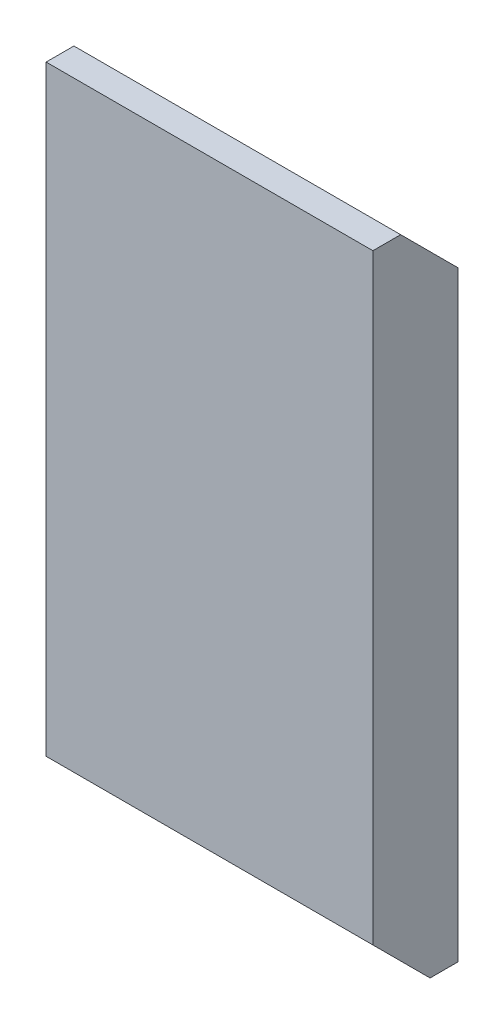
ISO-10303-21;
HEADER;
FILE_DESCRIPTION(('STEP AP214'),'2;1');
FILE_NAME('part.step','',(''),(''),'','','');
FILE_SCHEMA(('AUTOMOTIVE_DESIGN { 1 0 10303 214 1 1 1 1 }'));
ENDSEC;
DATA;
#1=APPLICATION_CONTEXT('core data for automotive mechanical design processes');
#2=APPLICATION_PROTOCOL_DEFINITION('international standard','automotive_design',2000,#1);
#3=PRODUCT_CONTEXT('',#1,'mechanical');
#4=PRODUCT('Part','Part','',(#3));
#5=PRODUCT_RELATED_PRODUCT_CATEGORY('part','',(#4));
#6=PRODUCT_DEFINITION_FORMATION('','',#4);
#7=PRODUCT_DEFINITION_CONTEXT('part definition',#1,'design');
#8=PRODUCT_DEFINITION('design','',#6,#7);
#9=PRODUCT_DEFINITION_SHAPE('','',#8);
#10=(LENGTH_UNIT() NAMED_UNIT(*) SI_UNIT(.MILLI.,.METRE.));
#11=(NAMED_UNIT(*) PLANE_ANGLE_UNIT() SI_UNIT($,.RADIAN.));
#12=(NAMED_UNIT(*) SI_UNIT($,.STERADIAN.) SOLID_ANGLE_UNIT());
#13=UNCERTAINTY_MEASURE_WITH_UNIT(LENGTH_MEASURE(1.E-05),#10,'distance_accuracy_value','');
#14=(GEOMETRIC_REPRESENTATION_CONTEXT(3) GLOBAL_UNCERTAINTY_ASSIGNED_CONTEXT((#13)) GLOBAL_UNIT_ASSIGNED_CONTEXT((#10,
#11,#12)) REPRESENTATION_CONTEXT('',''));
#15=CARTESIAN_POINT('',(0.,0.,0.));
#16=DIRECTION('',(0.,0.,1.));
#17=DIRECTION('',(1.,0.,0.));
#18=AXIS2_PLACEMENT_3D('',#15,#16,#17);
#19=CARTESIAN_POINT('',(12.7000000000001,-73.2155,6.60400000000022));
#20=DIRECTION('',(-1.,0.,0.));
#21=DIRECTION('',(0.,0.,1.));
#22=AXIS2_PLACEMENT_3D('',#19,#20,#21);
#23=PLANE('',#22);
#24=DIRECTION('',(0.,1.,0.));
#25=VECTOR('',#24,1.);
#26=CARTESIAN_POINT('',(12.7000000000001,-73.2155,6.60400000000022));
#27=LINE('',#26,#25);
#28=CARTESIAN_POINT('',(12.7000000000001,-68.7705,6.60400000000022));
#29=VERTEX_POINT('',#28);
#30=CARTESIAN_POINT('',(12.7000000000001,-22.0344999999999,6.60400000000022));
#31=VERTEX_POINT('',#30);
#32=EDGE_CURVE('E86',#29,#31,#27,.T.);
#33=ORIENTED_EDGE('',*,*,#32,.F.);
#34=DIRECTION('',(0.,-0.707106781186547,-0.70710678118655));
#35=VECTOR('',#34,1.);
#36=CARTESIAN_POINT('',(12.7000000000001,-68.7705,6.60400000000022));
#37=LINE('',#36,#35);
#38=CARTESIAN_POINT('',(12.7000000000001,-73.2155000000001,2.15900000000019));
#39=VERTEX_POINT('',#38);
#40=EDGE_CURVE('E116',#29,#39,#37,.T.);
#41=ORIENTED_EDGE('',*,*,#40,.T.);
#42=DIRECTION('',(0.,0.,-1.));
#43=VECTOR('',#42,1.);
#44=CARTESIAN_POINT('',(12.7000000000001,-73.2155,6.60400000000022));
#45=LINE('',#44,#43);
#46=CARTESIAN_POINT('',(12.7000000000001,-73.2155000000001,2.22044604925031E-13));
#47=VERTEX_POINT('',#46);
#48=EDGE_CURVE('E125',#39,#47,#45,.T.);
#49=ORIENTED_EDGE('',*,*,#48,.T.);
#50=DIRECTION('',(0.,1.,0.));
#51=VECTOR('',#50,1.);
#52=CARTESIAN_POINT('',(12.7000000000001,-73.2155000000001,2.22044604925031E-13));
#53=LINE('',#52,#51);
#54=CARTESIAN_POINT('',(12.7000000000001,-26.4795,2.22044604925031E-13));
#55=VERTEX_POINT('',#54);
#56=EDGE_CURVE('E129',#47,#55,#53,.T.);
#57=ORIENTED_EDGE('',*,*,#56,.T.);
#58=DIRECTION('',(0.,-0.70710678118655,-0.707106781186547));
#59=VECTOR('',#58,1.);
#60=CARTESIAN_POINT('',(12.7000000000001,-22.0345,4.4450000000002));
#61=LINE('',#60,#59);
#62=CARTESIAN_POINT('',(12.7000000000001,-22.0345,4.4450000000002));
#63=VERTEX_POINT('',#62);
#64=EDGE_CURVE('E108',#55,#63,#61,.F.);
#65=ORIENTED_EDGE('',*,*,#64,.T.);
#66=DIRECTION('',(0.,0.,-1.));
#67=VECTOR('',#66,1.);
#68=CARTESIAN_POINT('',(12.7000000000001,-22.0344999999999,6.60400000000022));
#69=LINE('',#68,#67);
#70=EDGE_CURVE('E101',#31,#63,#69,.T.);
#71=ORIENTED_EDGE('',*,*,#70,.F.);
#72=EDGE_LOOP('',(#33,#41,#49,#57,#65,#71));
#73=FACE_BOUND('',#72,.T.);
#74=ADVANCED_FACE('F34',(#73),#23,.F.);
#75=CARTESIAN_POINT('',(12.7000000000001,-22.0344999999999,6.60400000000022));
#76=DIRECTION('',(0.,-1.,0.));
#77=DIRECTION('',(0.,0.,-1.));
#78=AXIS2_PLACEMENT_3D('',#75,#76,#77);
#79=PLANE('',#78);
#80=ORIENTED_EDGE('',*,*,#70,.T.);
#81=DIRECTION('',(-1.,0.,0.));
#82=VECTOR('',#81,1.);
#83=CARTESIAN_POINT('',(12.7000000000001,-22.0345,4.4450000000002));
#84=LINE('',#83,#82);
#85=CARTESIAN_POINT('',(-12.7,-22.0344999999999,4.44499999999998));
#86=VERTEX_POINT('',#85);
#87=EDGE_CURVE('E42',#63,#86,#84,.T.);
#88=ORIENTED_EDGE('',*,*,#87,.T.);
#89=DIRECTION('',(0.,0.,-1.));
#90=VECTOR('',#89,1.);
#91=CARTESIAN_POINT('',(-12.7,-22.0344999999999,6.604));
#92=LINE('',#91,#90);
#93=CARTESIAN_POINT('',(-12.7,-22.0344999999999,6.604));
#94=VERTEX_POINT('',#93);
#95=EDGE_CURVE('E102',#94,#86,#92,.T.);
#96=ORIENTED_EDGE('',*,*,#95,.F.);
#97=DIRECTION('',(-1.,0.,0.));
#98=VECTOR('',#97,1.);
#99=CARTESIAN_POINT('',(12.7000000000001,-22.0344999999999,6.60400000000022));
#100=LINE('',#99,#98);
#101=EDGE_CURVE('E90',#31,#94,#100,.T.);
#102=ORIENTED_EDGE('',*,*,#101,.F.);
#103=EDGE_LOOP('',(#80,#88,#96,#102));
#104=FACE_BOUND('',#103,.T.);
#105=ADVANCED_FACE('F100',(#104),#79,.F.);
#106=CARTESIAN_POINT('',(-12.7,-73.2155,6.604));
#107=DIRECTION('',(1.,0.,0.));
#108=DIRECTION('',(0.,0.,-1.));
#109=AXIS2_PLACEMENT_3D('',#106,#107,#108);
#110=PLANE('',#109);
#111=DIRECTION('',(0.,0.,-1.));
#112=VECTOR('',#111,1.);
#113=CARTESIAN_POINT('',(-12.7,-73.2155,6.604));
#114=LINE('',#113,#112);
#115=CARTESIAN_POINT('',(-12.7,-73.2155,2.15900000000002));
#116=VERTEX_POINT('',#115);
#117=CARTESIAN_POINT('',(-12.7,-73.2155000000001,0.));
#118=VERTEX_POINT('',#117);
#119=EDGE_CURVE('E111',#116,#118,#114,.T.);
#120=ORIENTED_EDGE('',*,*,#119,.F.);
#121=DIRECTION('',(0.,0.707106781186547,0.70710678118655));
#122=VECTOR('',#121,1.);
#123=CARTESIAN_POINT('',(-12.7,-68.7705,6.604));
#124=LINE('',#123,#122);
#125=CARTESIAN_POINT('',(-12.7,-68.7705,6.604));
#126=VERTEX_POINT('',#125);
#127=EDGE_CURVE('E121',#116,#126,#124,.T.);
#128=ORIENTED_EDGE('',*,*,#127,.T.);
#129=DIRECTION('',(0.,-1.,0.));
#130=VECTOR('',#129,1.);
#131=CARTESIAN_POINT('',(-12.7,-73.2155,6.604));
#132=LINE('',#131,#130);
#133=EDGE_CURVE('E104',#94,#126,#132,.T.);
#134=ORIENTED_EDGE('',*,*,#133,.F.);
#135=ORIENTED_EDGE('',*,*,#95,.T.);
#136=DIRECTION('',(0.,0.70710678118655,0.707106781186547));
#137=VECTOR('',#136,1.);
#138=CARTESIAN_POINT('',(-12.7,-22.0344999999999,4.44499999999998));
#139=LINE('',#138,#137);
#140=CARTESIAN_POINT('',(-12.7,-26.4795,0.));
#141=VERTEX_POINT('',#140);
#142=EDGE_CURVE('E49',#86,#141,#139,.F.);
#143=ORIENTED_EDGE('',*,*,#142,.T.);
#144=DIRECTION('',(0.,-1.,0.));
#145=VECTOR('',#144,1.);
#146=CARTESIAN_POINT('',(-12.7,-73.2155000000001,0.));
#147=LINE('',#146,#145);
#148=EDGE_CURVE('E131',#141,#118,#147,.T.);
#149=ORIENTED_EDGE('',*,*,#148,.T.);
#150=EDGE_LOOP('',(#120,#128,#134,#135,#143,#149));
#151=FACE_BOUND('',#150,.T.);
#152=ADVANCED_FACE('F123',(#151),#110,.F.);
#153=CARTESIAN_POINT('',(-12.7,-73.2155,6.604));
#154=DIRECTION('',(0.,1.,0.));
#155=DIRECTION('',(0.,0.,1.));
#156=AXIS2_PLACEMENT_3D('',#153,#154,#155);
#157=PLANE('',#156);
#158=ORIENTED_EDGE('',*,*,#48,.F.);
#159=DIRECTION('',(-1.,0.,0.));
#160=VECTOR('',#159,1.);
#161=CARTESIAN_POINT('',(-12.7,-73.2155,2.15900000000002));
#162=LINE('',#161,#160);
#163=EDGE_CURVE('E118',#39,#116,#162,.T.);
#164=ORIENTED_EDGE('',*,*,#163,.T.);
#165=ORIENTED_EDGE('',*,*,#119,.T.);
#166=DIRECTION('',(1.,0.,0.));
#167=VECTOR('',#166,1.);
#168=CARTESIAN_POINT('',(-12.7,-73.2155000000001,0.));
#169=LINE('',#168,#167);
#170=EDGE_CURVE('E96',#118,#47,#169,.T.);
#171=ORIENTED_EDGE('',*,*,#170,.T.);
#172=EDGE_LOOP('',(#158,#164,#165,#171));
#173=FACE_BOUND('',#172,.T.);
#174=ADVANCED_FACE('F138',(#173),#157,.F.);
#175=CARTESIAN_POINT('',(0.,1.11022302462516E-13,6.604));
#176=DIRECTION('',(0.,0.,1.));
#177=DIRECTION('',(1.,0.,0.));
#178=AXIS2_PLACEMENT_3D('',#175,#176,#177);
#179=PLANE('',#178);
#180=ORIENTED_EDGE('',*,*,#133,.T.);
#181=DIRECTION('',(1.,0.,0.));
#182=VECTOR('',#181,1.);
#183=CARTESIAN_POINT('',(12.7000000000001,-68.7705,6.60400000000022));
#184=LINE('',#183,#182);
#185=EDGE_CURVE('E93',#126,#29,#184,.T.);
#186=ORIENTED_EDGE('',*,*,#185,.T.);
#187=ORIENTED_EDGE('',*,*,#32,.T.);
#188=ORIENTED_EDGE('',*,*,#101,.T.);
#189=EDGE_LOOP('',(#180,#186,#187,#188));
#190=FACE_BOUND('',#189,.T.);
#191=ADVANCED_FACE('F89',(#190),#179,.T.);
#192=CARTESIAN_POINT('',(0.,0.,0.));
#193=DIRECTION('',(0.,0.,1.));
#194=DIRECTION('',(1.,0.,0.));
#195=AXIS2_PLACEMENT_3D('',#192,#193,#194);
#196=PLANE('',#195);
#197=ORIENTED_EDGE('',*,*,#148,.F.);
#198=DIRECTION('',(1.,0.,0.));
#199=VECTOR('',#198,1.);
#200=CARTESIAN_POINT('',(0.,-26.4795,0.));
#201=LINE('',#200,#199);
#202=EDGE_CURVE('E11',#141,#55,#201,.T.);
#203=ORIENTED_EDGE('',*,*,#202,.T.);
#204=ORIENTED_EDGE('',*,*,#56,.F.);
#205=ORIENTED_EDGE('',*,*,#170,.F.);
#206=EDGE_LOOP('',(#197,#203,#204,#205));
#207=FACE_BOUND('',#206,.T.);
#208=ADVANCED_FACE('F142',(#207),#196,.F.);
#209=CARTESIAN_POINT('',(0.,-68.7705,6.604));
#210=DIRECTION('',(0.,-0.707106781186549,0.707106781186545));
#211=DIRECTION('',(-1.,0.,0.));
#212=AXIS2_PLACEMENT_3D('',#209,#210,#211);
#213=PLANE('',#212);
#214=ORIENTED_EDGE('',*,*,#127,.F.);
#215=ORIENTED_EDGE('',*,*,#163,.F.);
#216=ORIENTED_EDGE('',*,*,#40,.F.);
#217=ORIENTED_EDGE('',*,*,#185,.F.);
#218=EDGE_LOOP('',(#214,#215,#216,#217));
#219=FACE_BOUND('',#218,.T.);
#220=ADVANCED_FACE('F144',(#219),#213,.T.);
#221=CARTESIAN_POINT('',(12.7000000000001,-22.0345,4.4450000000002));
#222=DIRECTION('',(0.,-0.707106781186546,0.707106781186548));
#223=DIRECTION('',(-1.,0.,0.));
#224=AXIS2_PLACEMENT_3D('',#221,#222,#223);
#225=PLANE('',#224);
#226=ORIENTED_EDGE('',*,*,#64,.F.);
#227=ORIENTED_EDGE('',*,*,#202,.F.);
#228=ORIENTED_EDGE('',*,*,#142,.F.);
#229=ORIENTED_EDGE('',*,*,#87,.F.);
#230=EDGE_LOOP('',(#226,#227,#228,#229));
#231=FACE_BOUND('',#230,.T.);
#232=ADVANCED_FACE('F36',(#231),#225,.F.);
#233=CLOSED_SHELL('',(#74,#105,#152,#174,#191,#208,#220,#232));
#234=MANIFOLD_SOLID_BREP('B2',#233);
#235=ADVANCED_BREP_SHAPE_REPRESENTATION('',(#18,#234),#14);
#236=SHAPE_DEFINITION_REPRESENTATION(#9,#235);
ENDSEC;
END-ISO-10303-21;
